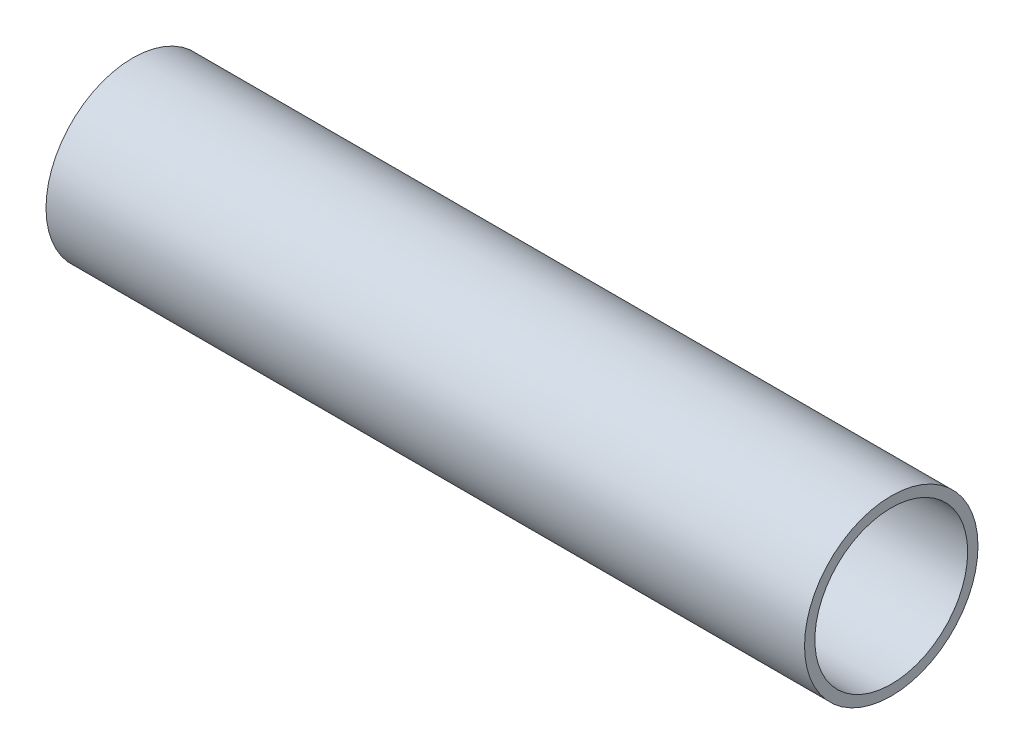
ISO-10303-21;
HEADER;
FILE_DESCRIPTION(('STEP AP214'),'2;1');
FILE_NAME('part.step','',(''),(''),'','','');
FILE_SCHEMA(('AUTOMOTIVE_DESIGN { 1 0 10303 214 1 1 1 1 }'));
ENDSEC;
DATA;
#1=APPLICATION_CONTEXT('core data for automotive mechanical design processes');
#2=APPLICATION_PROTOCOL_DEFINITION('international standard','automotive_design',2000,#1);
#3=PRODUCT_CONTEXT('',#1,'mechanical');
#4=PRODUCT('Part','Part','',(#3));
#5=PRODUCT_RELATED_PRODUCT_CATEGORY('part','',(#4));
#6=PRODUCT_DEFINITION_FORMATION('','',#4);
#7=PRODUCT_DEFINITION_CONTEXT('part definition',#1,'design');
#8=PRODUCT_DEFINITION('design','',#6,#7);
#9=PRODUCT_DEFINITION_SHAPE('','',#8);
#10=(LENGTH_UNIT() NAMED_UNIT(*) SI_UNIT(.MILLI.,.METRE.));
#11=(NAMED_UNIT(*) PLANE_ANGLE_UNIT() SI_UNIT($,.RADIAN.));
#12=(NAMED_UNIT(*) SI_UNIT($,.STERADIAN.) SOLID_ANGLE_UNIT());
#13=UNCERTAINTY_MEASURE_WITH_UNIT(LENGTH_MEASURE(1.E-05),#10,'distance_accuracy_value','');
#14=(GEOMETRIC_REPRESENTATION_CONTEXT(3) GLOBAL_UNCERTAINTY_ASSIGNED_CONTEXT((#13)) GLOBAL_UNIT_ASSIGNED_CONTEXT((#10,
#11,#12)) REPRESENTATION_CONTEXT('',''));
#15=CARTESIAN_POINT('',(0.,0.,0.));
#16=DIRECTION('',(0.,0.,1.));
#17=DIRECTION('',(1.,0.,0.));
#18=AXIS2_PLACEMENT_3D('',#15,#16,#17);
#19=CARTESIAN_POINT('',(55.1,0.,0.));
#20=DIRECTION('',(1.,0.,0.));
#21=DIRECTION('',(0.,0.,-1.));
#22=AXIS2_PLACEMENT_3D('',#19,#20,#21);
#23=PLANE('',#22);
#24=CARTESIAN_POINT('',(55.1,0.,0.));
#25=DIRECTION('',(1.,0.,0.));
#26=DIRECTION('',(0.,0.,-1.));
#27=AXIS2_PLACEMENT_3D('',#24,#25,#26);
#28=CIRCLE('',#27,6.3);
#29=CARTESIAN_POINT('',(55.1,0.,-6.3));
#30=VERTEX_POINT('',#29);
#31=EDGE_CURVE('E11',#30,#30,#28,.T.);
#32=ORIENTED_EDGE('',*,*,#31,.T.);
#33=EDGE_LOOP('',(#32));
#34=FACE_BOUND('',#33,.T.);
#35=CARTESIAN_POINT('',(55.1,0.,0.));
#36=DIRECTION('',(1.,0.,0.));
#37=DIRECTION('',(0.,0.,-1.));
#38=AXIS2_PLACEMENT_3D('',#35,#36,#37);
#39=CIRCLE('',#38,5.55);
#40=CARTESIAN_POINT('',(55.1,0.,-5.55));
#41=VERTEX_POINT('',#40);
#42=EDGE_CURVE('E50',#41,#41,#39,.T.);
#43=ORIENTED_EDGE('',*,*,#42,.F.);
#44=EDGE_LOOP('',(#43));
#45=FACE_BOUND('',#44,.T.);
#46=ADVANCED_FACE('F39',(#34,#45),#23,.T.);
#47=CARTESIAN_POINT('',(0.,0.,0.));
#48=DIRECTION('',(1.,0.,0.));
#49=DIRECTION('',(0.,0.,-1.));
#50=AXIS2_PLACEMENT_3D('',#47,#48,#49);
#51=PLANE('',#50);
#52=CARTESIAN_POINT('',(0.,0.,0.));
#53=DIRECTION('',(1.,0.,0.));
#54=DIRECTION('',(0.,0.,-1.));
#55=AXIS2_PLACEMENT_3D('',#52,#53,#54);
#56=CIRCLE('',#55,6.3);
#57=CARTESIAN_POINT('',(0.,0.,-6.3));
#58=VERTEX_POINT('',#57);
#59=EDGE_CURVE('E43',#58,#58,#56,.T.);
#60=ORIENTED_EDGE('',*,*,#59,.F.);
#61=EDGE_LOOP('',(#60));
#62=FACE_BOUND('',#61,.T.);
#63=CARTESIAN_POINT('',(0.,0.,0.));
#64=DIRECTION('',(1.,0.,0.));
#65=DIRECTION('',(0.,0.,-1.));
#66=AXIS2_PLACEMENT_3D('',#63,#64,#65);
#67=CIRCLE('',#66,5.55);
#68=CARTESIAN_POINT('',(0.,0.,-5.55));
#69=VERTEX_POINT('',#68);
#70=EDGE_CURVE('E52',#69,#69,#67,.T.);
#71=ORIENTED_EDGE('',*,*,#70,.T.);
#72=EDGE_LOOP('',(#71));
#73=FACE_BOUND('',#72,.T.);
#74=ADVANCED_FACE('F62',(#62,#73),#51,.F.);
#75=CARTESIAN_POINT('',(55.1,0.,0.));
#76=DIRECTION('',(-1.,0.,0.));
#77=DIRECTION('',(0.,0.,1.));
#78=AXIS2_PLACEMENT_3D('',#75,#76,#77);
#79=CYLINDRICAL_SURFACE('',#78,6.3);
#80=ORIENTED_EDGE('',*,*,#31,.F.);
#81=EDGE_LOOP('',(#80));
#82=FACE_BOUND('',#81,.T.);
#83=ORIENTED_EDGE('',*,*,#59,.T.);
#84=EDGE_LOOP('',(#83));
#85=FACE_BOUND('',#84,.T.);
#86=ADVANCED_FACE('F41',(#82,#85),#79,.T.);
#87=CARTESIAN_POINT('',(55.1,0.,0.));
#88=DIRECTION('',(-1.,0.,0.));
#89=DIRECTION('',(0.,0.,1.));
#90=AXIS2_PLACEMENT_3D('',#87,#88,#89);
#91=CYLINDRICAL_SURFACE('',#90,5.55);
#92=ORIENTED_EDGE('',*,*,#42,.T.);
#93=EDGE_LOOP('',(#92));
#94=FACE_BOUND('',#93,.T.);
#95=ORIENTED_EDGE('',*,*,#70,.F.);
#96=EDGE_LOOP('',(#95));
#97=FACE_BOUND('',#96,.T.);
#98=ADVANCED_FACE('F58',(#94,#97),#91,.F.);
#99=CLOSED_SHELL('',(#46,#74,#86,#98));
#100=MANIFOLD_SOLID_BREP('B2',#99);
#101=ADVANCED_BREP_SHAPE_REPRESENTATION('',(#18,#100),#14);
#102=SHAPE_DEFINITION_REPRESENTATION(#9,#101);
ENDSEC;
END-ISO-10303-21;
